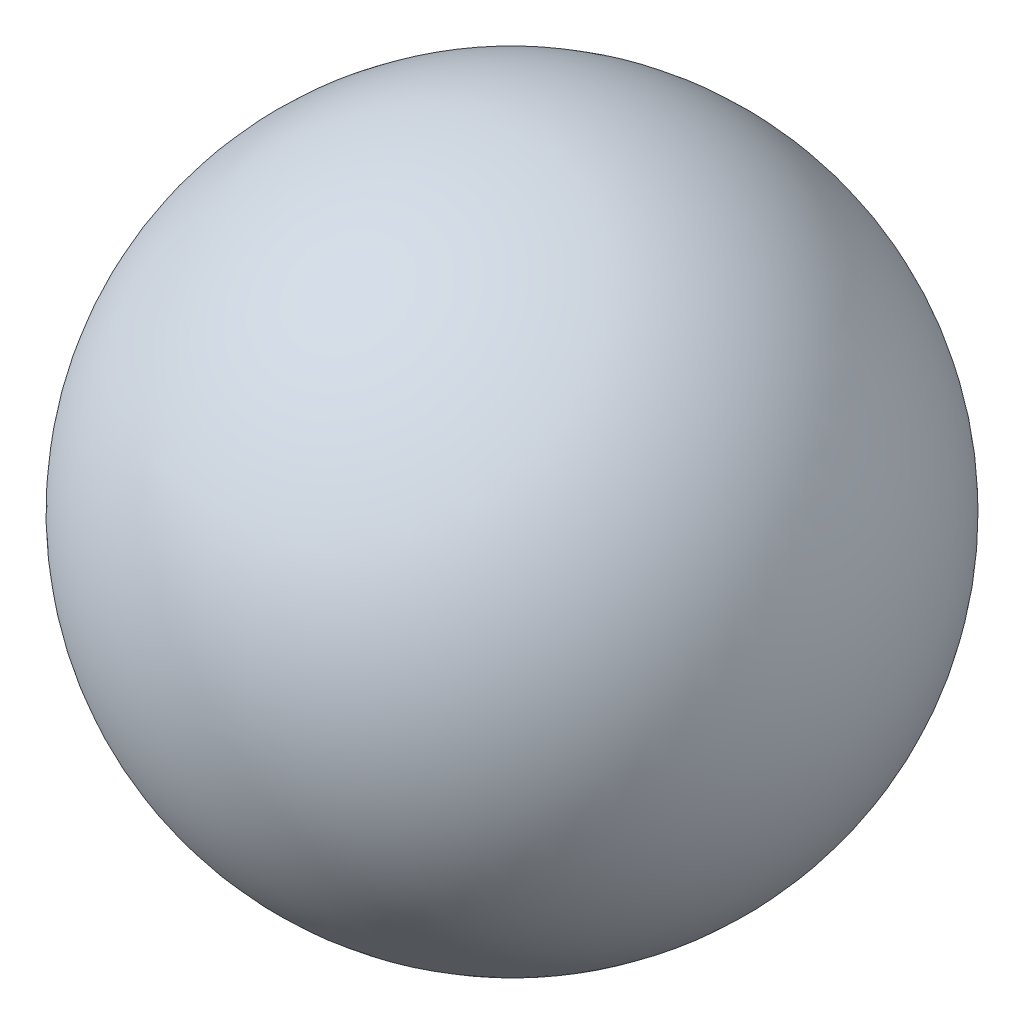
ISO-10303-21;
HEADER;
FILE_DESCRIPTION(('STEP AP214'),'2;1');
FILE_NAME('part.step','',(''),(''),'','','');
FILE_SCHEMA(('AUTOMOTIVE_DESIGN { 1 0 10303 214 1 1 1 1 }'));
ENDSEC;
DATA;
#1=APPLICATION_CONTEXT('core data for automotive mechanical design processes');
#2=APPLICATION_PROTOCOL_DEFINITION('international standard','automotive_design',2000,#1);
#3=PRODUCT_CONTEXT('',#1,'mechanical');
#4=PRODUCT('Part','Part','',(#3));
#5=PRODUCT_RELATED_PRODUCT_CATEGORY('part','',(#4));
#6=PRODUCT_DEFINITION_FORMATION('','',#4);
#7=PRODUCT_DEFINITION_CONTEXT('part definition',#1,'design');
#8=PRODUCT_DEFINITION('design','',#6,#7);
#9=PRODUCT_DEFINITION_SHAPE('','',#8);
#10=(LENGTH_UNIT() NAMED_UNIT(*) SI_UNIT(.MILLI.,.METRE.));
#11=(NAMED_UNIT(*) PLANE_ANGLE_UNIT() SI_UNIT($,.RADIAN.));
#12=(NAMED_UNIT(*) SI_UNIT($,.STERADIAN.) SOLID_ANGLE_UNIT());
#13=UNCERTAINTY_MEASURE_WITH_UNIT(LENGTH_MEASURE(1.E-05),#10,'distance_accuracy_value','');
#14=(GEOMETRIC_REPRESENTATION_CONTEXT(3) GLOBAL_UNCERTAINTY_ASSIGNED_CONTEXT((#13)) GLOBAL_UNIT_ASSIGNED_CONTEXT((#10,
#11,#12)) REPRESENTATION_CONTEXT('',''));
#15=CARTESIAN_POINT('',(0.,0.,0.));
#16=DIRECTION('',(0.,0.,1.));
#17=DIRECTION('',(1.,0.,0.));
#18=AXIS2_PLACEMENT_3D('',#15,#16,#17);
#19=CARTESIAN_POINT('',(64.16,69.1772975263212,5.33874479206882));
#20=DIRECTION('',(0.,0.997035261178115,0.0769460068326364));
#21=DIRECTION('',(0.173648177666934,-0.0757770240921106,0.981888055234759));
#22=AXIS2_PLACEMENT_3D('',#19,#20,#21);
#23=SPHERICAL_SURFACE('',#22,7.15);
#24=CARTESIAN_POINT('',(64.16,62.0484954088977,4.78858084321547));
#25=VERTEX_POINT('',#24);
#26=VERTEX_LOOP('',#25);
#27=FACE_BOUND('',#26,.T.);
#28=CARTESIAN_POINT('',(64.16,76.3060996437447,5.88890874092216));
#29=VERTEX_POINT('',#28);
#30=VERTEX_LOOP('',#29);
#31=FACE_BOUND('',#30,.T.);
#32=ADVANCED_FACE('F15',(#27,#31),#23,.T.);
#33=CLOSED_SHELL('',(#32));
#34=MANIFOLD_SOLID_BREP('B1',#33);
#35=ADVANCED_BREP_SHAPE_REPRESENTATION('',(#18,#34),#14);
#36=SHAPE_DEFINITION_REPRESENTATION(#9,#35);
ENDSEC;
END-ISO-10303-21;
